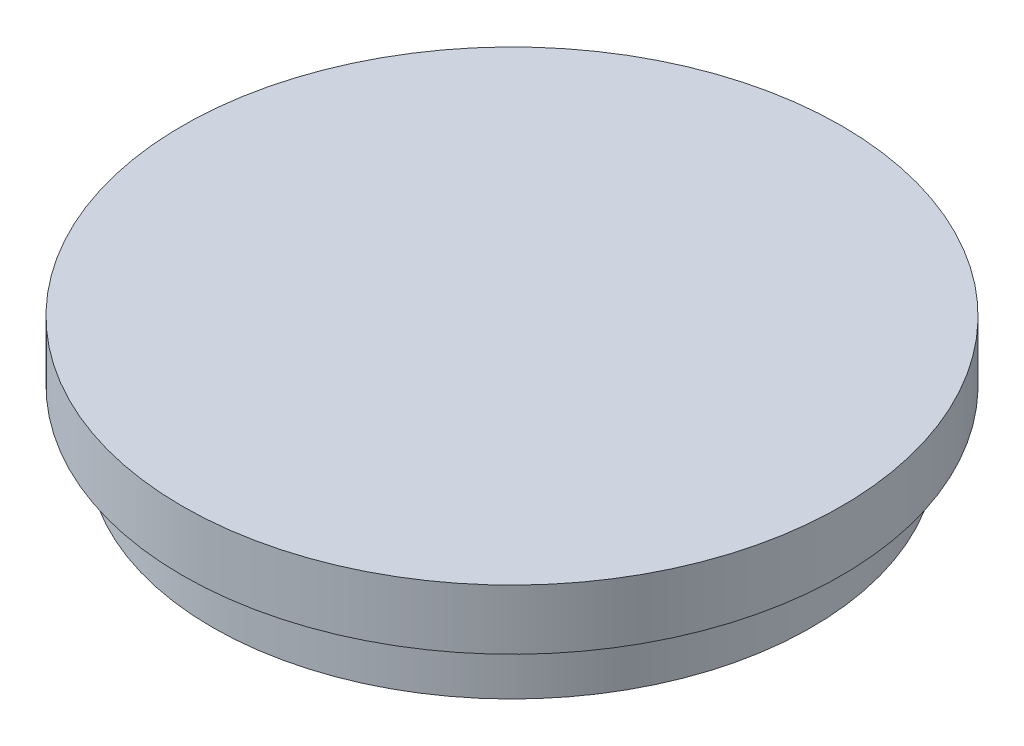
ISO-10303-21;
HEADER;
FILE_DESCRIPTION(('STEP AP214'),'2;1');
FILE_NAME('part.step','',(''),(''),'','','');
FILE_SCHEMA(('AUTOMOTIVE_DESIGN { 1 0 10303 214 1 1 1 1 }'));
ENDSEC;
DATA;
#1=APPLICATION_CONTEXT('core data for automotive mechanical design processes');
#2=APPLICATION_PROTOCOL_DEFINITION('international standard','automotive_design',2000,#1);
#3=PRODUCT_CONTEXT('',#1,'mechanical');
#4=PRODUCT('Part','Part','',(#3));
#5=PRODUCT_RELATED_PRODUCT_CATEGORY('part','',(#4));
#6=PRODUCT_DEFINITION_FORMATION('','',#4);
#7=PRODUCT_DEFINITION_CONTEXT('part definition',#1,'design');
#8=PRODUCT_DEFINITION('design','',#6,#7);
#9=PRODUCT_DEFINITION_SHAPE('','',#8);
#10=(LENGTH_UNIT() NAMED_UNIT(*) SI_UNIT(.MILLI.,.METRE.));
#11=(NAMED_UNIT(*) PLANE_ANGLE_UNIT() SI_UNIT($,.RADIAN.));
#12=(NAMED_UNIT(*) SI_UNIT($,.STERADIAN.) SOLID_ANGLE_UNIT());
#13=UNCERTAINTY_MEASURE_WITH_UNIT(LENGTH_MEASURE(1.E-05),#10,'distance_accuracy_value','');
#14=(GEOMETRIC_REPRESENTATION_CONTEXT(3) GLOBAL_UNCERTAINTY_ASSIGNED_CONTEXT((#13)) GLOBAL_UNIT_ASSIGNED_CONTEXT((#10,
#11,#12)) REPRESENTATION_CONTEXT('',''));
#15=CARTESIAN_POINT('',(0.,0.,0.));
#16=DIRECTION('',(0.,0.,1.));
#17=DIRECTION('',(1.,0.,0.));
#18=AXIS2_PLACEMENT_3D('',#15,#16,#17);
#19=CARTESIAN_POINT('',(0.,2.,0.));
#20=DIRECTION('',(0.,-1.,0.));
#21=DIRECTION('',(0.,0.,-1.));
#22=AXIS2_PLACEMENT_3D('',#19,#20,#21);
#23=CYLINDRICAL_SURFACE('',#22,10.);
#24=CARTESIAN_POINT('',(0.,2.,0.));
#25=DIRECTION('',(0.,1.,0.));
#26=DIRECTION('',(0.,0.,1.));
#27=AXIS2_PLACEMENT_3D('',#24,#25,#26);
#28=CIRCLE('',#27,10.);
#29=CARTESIAN_POINT('',(0.,2.,10.));
#30=VERTEX_POINT('',#29);
#31=EDGE_CURVE('E10',#30,#30,#28,.T.);
#32=ORIENTED_EDGE('',*,*,#31,.F.);
#33=EDGE_LOOP('',(#32));
#34=FACE_BOUND('',#33,.T.);
#35=CARTESIAN_POINT('',(0.,0.,0.));
#36=DIRECTION('',(0.,1.,0.));
#37=DIRECTION('',(0.,0.,1.));
#38=AXIS2_PLACEMENT_3D('',#35,#36,#37);
#39=CIRCLE('',#38,10.);
#40=CARTESIAN_POINT('',(0.,0.,10.));
#41=VERTEX_POINT('',#40);
#42=EDGE_CURVE('E40',#41,#41,#39,.T.);
#43=ORIENTED_EDGE('',*,*,#42,.T.);
#44=EDGE_LOOP('',(#43));
#45=FACE_BOUND('',#44,.T.);
#46=ADVANCED_FACE('F37',(#34,#45),#23,.T.);
#47=CARTESIAN_POINT('',(0.,0.,0.));
#48=DIRECTION('',(0.,1.,0.));
#49=DIRECTION('',(0.,0.,1.));
#50=AXIS2_PLACEMENT_3D('',#47,#48,#49);
#51=PLANE('',#50);
#52=ORIENTED_EDGE('',*,*,#42,.F.);
#53=EDGE_LOOP('',(#52));
#54=FACE_BOUND('',#53,.T.);
#55=ADVANCED_FACE('F64',(#54),#51,.F.);
#56=CARTESIAN_POINT('',(0.,4.,0.));
#57=DIRECTION('',(0.,-1.,0.));
#58=DIRECTION('',(0.,0.,-1.));
#59=AXIS2_PLACEMENT_3D('',#56,#57,#58);
#60=CYLINDRICAL_SURFACE('',#59,11.);
#61=CARTESIAN_POINT('',(0.,4.,0.));
#62=DIRECTION('',(0.,1.,0.));
#63=DIRECTION('',(0.,0.,1.));
#64=AXIS2_PLACEMENT_3D('',#61,#62,#63);
#65=CIRCLE('',#64,11.);
#66=CARTESIAN_POINT('',(0.,4.,11.));
#67=VERTEX_POINT('',#66);
#68=EDGE_CURVE('E49',#67,#67,#65,.T.);
#69=ORIENTED_EDGE('',*,*,#68,.F.);
#70=EDGE_LOOP('',(#69));
#71=FACE_BOUND('',#70,.T.);
#72=CARTESIAN_POINT('',(0.,2.,0.));
#73=DIRECTION('',(0.,1.,0.));
#74=DIRECTION('',(0.,0.,1.));
#75=AXIS2_PLACEMENT_3D('',#72,#73,#74);
#76=CIRCLE('',#75,11.);
#77=CARTESIAN_POINT('',(0.,2.,11.));
#78=VERTEX_POINT('',#77);
#79=EDGE_CURVE('E51',#78,#78,#76,.T.);
#80=ORIENTED_EDGE('',*,*,#79,.T.);
#81=EDGE_LOOP('',(#80));
#82=FACE_BOUND('',#81,.T.);
#83=ADVANCED_FACE('F61',(#71,#82),#60,.T.);
#84=CARTESIAN_POINT('',(0.,4.,0.));
#85=DIRECTION('',(0.,1.,0.));
#86=DIRECTION('',(0.,0.,1.));
#87=AXIS2_PLACEMENT_3D('',#84,#85,#86);
#88=PLANE('',#87);
#89=ORIENTED_EDGE('',*,*,#68,.T.);
#90=EDGE_LOOP('',(#89));
#91=FACE_BOUND('',#90,.T.);
#92=ADVANCED_FACE('F59',(#91),#88,.T.);
#93=CARTESIAN_POINT('',(0.,2.,0.));
#94=DIRECTION('',(0.,1.,0.));
#95=DIRECTION('',(0.,0.,1.));
#96=AXIS2_PLACEMENT_3D('',#93,#94,#95);
#97=PLANE('',#96);
#98=ORIENTED_EDGE('',*,*,#31,.T.);
#99=EDGE_LOOP('',(#98));
#100=FACE_BOUND('',#99,.T.);
#101=ORIENTED_EDGE('',*,*,#79,.F.);
#102=EDGE_LOOP('',(#101));
#103=FACE_BOUND('',#102,.T.);
#104=ADVANCED_FACE('F68',(#100,#103),#97,.F.);
#105=CLOSED_SHELL('',(#46,#55,#83,#92,#104));
#106=MANIFOLD_SOLID_BREP('B2',#105);
#107=ADVANCED_BREP_SHAPE_REPRESENTATION('',(#18,#106),#14);
#108=SHAPE_DEFINITION_REPRESENTATION(#9,#107);
ENDSEC;
END-ISO-10303-21;
